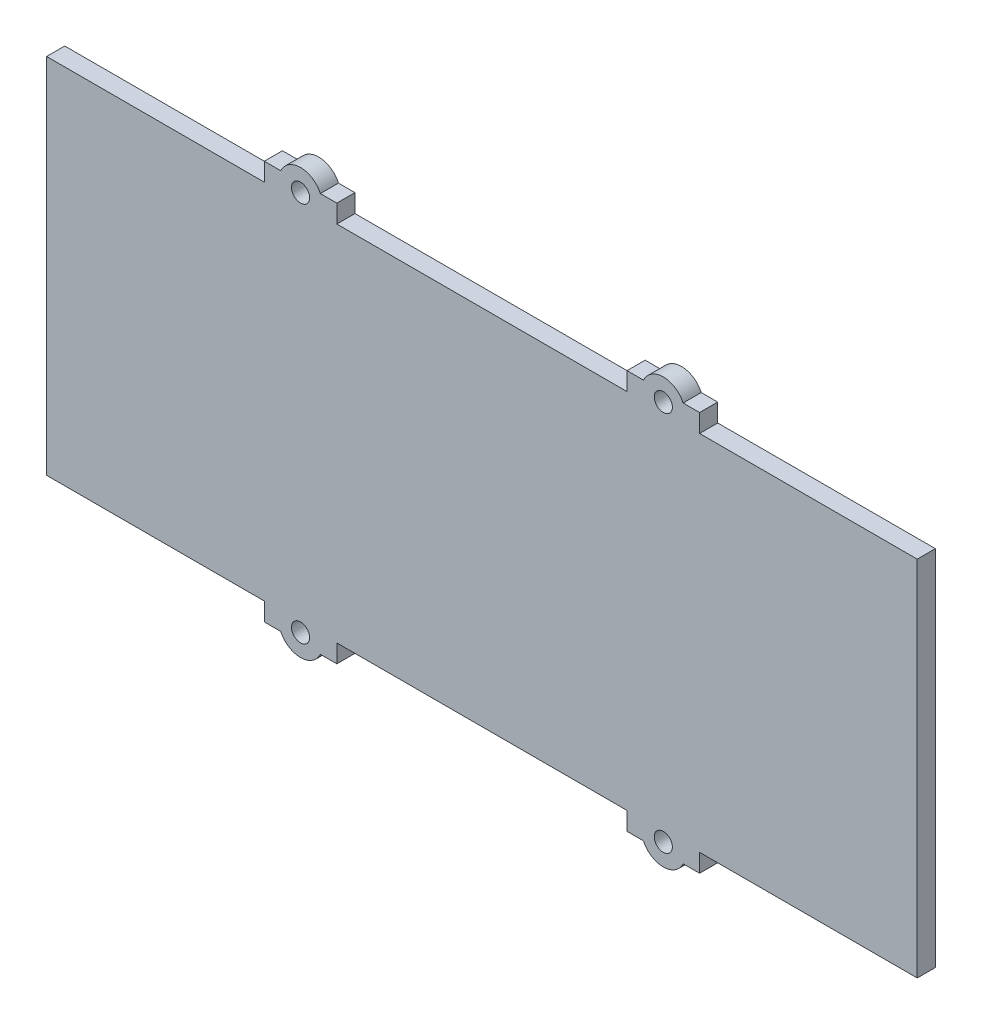
ISO-10303-21;
HEADER;
FILE_DESCRIPTION(('STEP AP214'),'2;1');
FILE_NAME('part.step','',(''),(''),'','','');
FILE_SCHEMA(('AUTOMOTIVE_DESIGN { 1 0 10303 214 1 1 1 1 }'));
ENDSEC;
DATA;
#1=APPLICATION_CONTEXT('core data for automotive mechanical design processes');
#2=APPLICATION_PROTOCOL_DEFINITION('international standard','automotive_design',2000,#1);
#3=PRODUCT_CONTEXT('',#1,'mechanical');
#4=PRODUCT('Part','Part','',(#3));
#5=PRODUCT_RELATED_PRODUCT_CATEGORY('part','',(#4));
#6=PRODUCT_DEFINITION_FORMATION('','',#4);
#7=PRODUCT_DEFINITION_CONTEXT('part definition',#1,'design');
#8=PRODUCT_DEFINITION('design','',#6,#7);
#9=PRODUCT_DEFINITION_SHAPE('','',#8);
#10=(LENGTH_UNIT() NAMED_UNIT(*) SI_UNIT(.MILLI.,.METRE.));
#11=(NAMED_UNIT(*) PLANE_ANGLE_UNIT() SI_UNIT($,.RADIAN.));
#12=(NAMED_UNIT(*) SI_UNIT($,.STERADIAN.) SOLID_ANGLE_UNIT());
#13=UNCERTAINTY_MEASURE_WITH_UNIT(LENGTH_MEASURE(1.E-05),#10,'distance_accuracy_value','');
#14=(GEOMETRIC_REPRESENTATION_CONTEXT(3) GLOBAL_UNCERTAINTY_ASSIGNED_CONTEXT((#13)) GLOBAL_UNIT_ASSIGNED_CONTEXT((#10,
#11,#12)) REPRESENTATION_CONTEXT('',''));
#15=CARTESIAN_POINT('',(0.,0.,0.));
#16=DIRECTION('',(0.,0.,1.));
#17=DIRECTION('',(1.,0.,0.));
#18=AXIS2_PLACEMENT_3D('',#15,#16,#17);
#19=CARTESIAN_POINT('',(0.,-55.,0.));
#20=DIRECTION('',(0.,1.,0.));
#21=DIRECTION('',(0.,0.,-1.));
#22=AXIS2_PLACEMENT_3D('',#19,#20,#21);
#23=PLANE('',#22);
#24=DIRECTION('',(1.,0.,0.));
#25=VECTOR('',#24,1.);
#26=CARTESIAN_POINT('',(-60.,-55.,0.));
#27=LINE('',#26,#25);
#28=CARTESIAN_POINT('',(-60.,-55.,0.));
#29=VERTEX_POINT('',#28);
#30=CARTESIAN_POINT('',(-55.4543560573178,-55.,0.));
#31=VERTEX_POINT('',#30);
#32=EDGE_CURVE('E229',#29,#31,#27,.T.);
#33=ORIENTED_EDGE('',*,*,#32,.T.);
#34=DIRECTION('',(0.,0.,1.));
#35=VECTOR('',#34,1.);
#36=CARTESIAN_POINT('',(-55.4543560573178,-55.,0.));
#37=LINE('',#36,#35);
#38=CARTESIAN_POINT('',(-55.4543560573178,-55.,5.));
#39=VERTEX_POINT('',#38);
#40=EDGE_CURVE('E11',#31,#39,#37,.T.);
#41=ORIENTED_EDGE('',*,*,#40,.T.);
#42=DIRECTION('',(-1.,0.,0.));
#43=VECTOR('',#42,1.);
#44=CARTESIAN_POINT('',(-60.,-55.,5.));
#45=LINE('',#44,#43);
#46=CARTESIAN_POINT('',(-60.,-55.,5.));
#47=VERTEX_POINT('',#46);
#48=EDGE_CURVE('E215',#39,#47,#45,.T.);
#49=ORIENTED_EDGE('',*,*,#48,.T.);
#50=DIRECTION('',(0.,0.,-1.));
#51=VECTOR('',#50,1.);
#52=CARTESIAN_POINT('',(-60.,-55.,0.));
#53=LINE('',#52,#51);
#54=EDGE_CURVE('E268',#47,#29,#53,.T.);
#55=ORIENTED_EDGE('',*,*,#54,.T.);
#56=EDGE_LOOP('',(#33,#41,#49,#55));
#57=FACE_BOUND('',#56,.T.);
#58=ADVANCED_FACE('F33',(#57),#23,.F.);
#59=CARTESIAN_POINT('',(0.,-55.,0.));
#60=DIRECTION('',(0.,1.,0.));
#61=DIRECTION('',(0.,0.,-1.));
#62=AXIS2_PLACEMENT_3D('',#59,#60,#61);
#63=PLANE('',#62);
#64=DIRECTION('',(0.,0.,1.));
#65=VECTOR('',#64,1.);
#66=CARTESIAN_POINT('',(44.5456439426821,-55.,0.));
#67=LINE('',#66,#65);
#68=CARTESIAN_POINT('',(44.5456439426821,-55.,5.));
#69=VERTEX_POINT('',#68);
#70=CARTESIAN_POINT('',(44.5456439426821,-55.,0.));
#71=VERTEX_POINT('',#70);
#72=EDGE_CURVE('E431',#69,#71,#67,.F.);
#73=ORIENTED_EDGE('',*,*,#72,.F.);
#74=DIRECTION('',(1.,0.,0.));
#75=VECTOR('',#74,1.);
#76=CARTESIAN_POINT('',(60.,-55.,5.));
#77=LINE('',#76,#75);
#78=CARTESIAN_POINT('',(40.,-55.,5.));
#79=VERTEX_POINT('',#78);
#80=EDGE_CURVE('E325',#79,#69,#77,.T.);
#81=ORIENTED_EDGE('',*,*,#80,.F.);
#82=DIRECTION('',(0.,0.,1.));
#83=VECTOR('',#82,1.);
#84=CARTESIAN_POINT('',(40.,-55.,0.));
#85=LINE('',#84,#83);
#86=CARTESIAN_POINT('',(40.,-55.,0.));
#87=VERTEX_POINT('',#86);
#88=EDGE_CURVE('E328',#87,#79,#85,.T.);
#89=ORIENTED_EDGE('',*,*,#88,.F.);
#90=DIRECTION('',(-1.,0.,0.));
#91=VECTOR('',#90,1.);
#92=CARTESIAN_POINT('',(60.,-55.,0.));
#93=LINE('',#92,#91);
#94=EDGE_CURVE('E331',#71,#87,#93,.T.);
#95=ORIENTED_EDGE('',*,*,#94,.F.);
#96=EDGE_LOOP('',(#73,#81,#89,#95));
#97=FACE_BOUND('',#96,.T.);
#98=ADVANCED_FACE('F450',(#97),#63,.F.);
#99=DIRECTION('',(0.,0.,1.));
#100=VECTOR('',#99,1.);
#101=CARTESIAN_POINT('',(55.4543560573178,-55.,0.));
#102=LINE('',#101,#100);
#103=CARTESIAN_POINT('',(55.4543560573178,-55.,0.));
#104=VERTEX_POINT('',#103);
#105=CARTESIAN_POINT('',(55.4543560573178,-55.,5.));
#106=VERTEX_POINT('',#105);
#107=EDGE_CURVE('E428',#104,#106,#102,.T.);
#108=ORIENTED_EDGE('',*,*,#107,.F.);
#109=CARTESIAN_POINT('',(60.,-55.,0.));
#110=VERTEX_POINT('',#109);
#111=EDGE_CURVE('E332',#110,#104,#93,.T.);
#112=ORIENTED_EDGE('',*,*,#111,.F.);
#113=DIRECTION('',(0.,0.,-1.));
#114=VECTOR('',#113,1.);
#115=CARTESIAN_POINT('',(60.,-55.,0.));
#116=LINE('',#115,#114);
#117=CARTESIAN_POINT('',(60.,-55.,5.));
#118=VERTEX_POINT('',#117);
#119=EDGE_CURVE('E320',#118,#110,#116,.T.);
#120=ORIENTED_EDGE('',*,*,#119,.F.);
#121=EDGE_CURVE('E323',#106,#118,#77,.T.);
#122=ORIENTED_EDGE('',*,*,#121,.F.);
#123=EDGE_LOOP('',(#108,#112,#120,#122));
#124=FACE_BOUND('',#123,.T.);
#125=ADVANCED_FACE('F447',(#124),#63,.F.);
#126=CARTESIAN_POINT('',(0.,55.,0.));
#127=DIRECTION('',(0.,-1.,0.));
#128=DIRECTION('',(0.,0.,-1.));
#129=AXIS2_PLACEMENT_3D('',#126,#127,#128);
#130=PLANE('',#129);
#131=DIRECTION('',(0.,0.,1.));
#132=VECTOR('',#131,1.);
#133=CARTESIAN_POINT('',(-44.5456439426821,55.,0.));
#134=LINE('',#133,#132);
#135=CARTESIAN_POINT('',(-44.5456439426821,55.,5.));
#136=VERTEX_POINT('',#135);
#137=CARTESIAN_POINT('',(-44.5456439426821,55.,0.));
#138=VERTEX_POINT('',#137);
#139=EDGE_CURVE('E425',#136,#138,#134,.F.);
#140=ORIENTED_EDGE('',*,*,#139,.F.);
#141=DIRECTION('',(-1.,0.,0.));
#142=VECTOR('',#141,1.);
#143=CARTESIAN_POINT('',(-60.,55.,5.));
#144=LINE('',#143,#142);
#145=CARTESIAN_POINT('',(-40.,55.,5.));
#146=VERTEX_POINT('',#145);
#147=EDGE_CURVE('E294',#146,#136,#144,.T.);
#148=ORIENTED_EDGE('',*,*,#147,.F.);
#149=DIRECTION('',(0.,0.,1.));
#150=VECTOR('',#149,1.);
#151=CARTESIAN_POINT('',(-40.,55.,0.));
#152=LINE('',#151,#150);
#153=CARTESIAN_POINT('',(-40.,55.,0.));
#154=VERTEX_POINT('',#153);
#155=EDGE_CURVE('E297',#154,#146,#152,.T.);
#156=ORIENTED_EDGE('',*,*,#155,.F.);
#157=DIRECTION('',(1.,0.,0.));
#158=VECTOR('',#157,1.);
#159=CARTESIAN_POINT('',(-60.,55.,0.));
#160=LINE('',#159,#158);
#161=EDGE_CURVE('E300',#138,#154,#160,.T.);
#162=ORIENTED_EDGE('',*,*,#161,.F.);
#163=EDGE_LOOP('',(#140,#148,#156,#162));
#164=FACE_BOUND('',#163,.T.);
#165=ADVANCED_FACE('F489',(#164),#130,.F.);
#166=DIRECTION('',(0.,0.,1.));
#167=VECTOR('',#166,1.);
#168=CARTESIAN_POINT('',(-55.4543560573178,55.,0.));
#169=LINE('',#168,#167);
#170=CARTESIAN_POINT('',(-55.4543560573178,55.,0.));
#171=VERTEX_POINT('',#170);
#172=CARTESIAN_POINT('',(-55.4543560573178,55.,5.));
#173=VERTEX_POINT('',#172);
#174=EDGE_CURVE('E422',#171,#173,#169,.T.);
#175=ORIENTED_EDGE('',*,*,#174,.F.);
#176=CARTESIAN_POINT('',(-60.,55.,0.));
#177=VERTEX_POINT('',#176);
#178=EDGE_CURVE('E301',#177,#171,#160,.T.);
#179=ORIENTED_EDGE('',*,*,#178,.F.);
#180=DIRECTION('',(0.,0.,-1.));
#181=VECTOR('',#180,1.);
#182=CARTESIAN_POINT('',(-60.,55.,0.));
#183=LINE('',#182,#181);
#184=CARTESIAN_POINT('',(-60.,55.,5.));
#185=VERTEX_POINT('',#184);
#186=EDGE_CURVE('E289',#185,#177,#183,.T.);
#187=ORIENTED_EDGE('',*,*,#186,.F.);
#188=EDGE_CURVE('E292',#173,#185,#144,.T.);
#189=ORIENTED_EDGE('',*,*,#188,.F.);
#190=EDGE_LOOP('',(#175,#179,#187,#189));
#191=FACE_BOUND('',#190,.T.);
#192=ADVANCED_FACE('F482',(#191),#130,.F.);
#193=CARTESIAN_POINT('',(0.,55.,0.));
#194=DIRECTION('',(0.,-1.,0.));
#195=DIRECTION('',(0.,0.,-1.));
#196=AXIS2_PLACEMENT_3D('',#193,#194,#195);
#197=PLANE('',#196);
#198=DIRECTION('',(-1.,0.,0.));
#199=VECTOR('',#198,1.);
#200=CARTESIAN_POINT('',(60.,55.,0.));
#201=LINE('',#200,#199);
#202=CARTESIAN_POINT('',(60.,55.,0.));
#203=VERTEX_POINT('',#202);
#204=CARTESIAN_POINT('',(55.4543560573178,55.,0.));
#205=VERTEX_POINT('',#204);
#206=EDGE_CURVE('E355',#203,#205,#201,.T.);
#207=ORIENTED_EDGE('',*,*,#206,.T.);
#208=DIRECTION('',(0.,0.,1.));
#209=VECTOR('',#208,1.);
#210=CARTESIAN_POINT('',(55.4543560573178,55.,0.));
#211=LINE('',#210,#209);
#212=CARTESIAN_POINT('',(55.4543560573178,55.,5.));
#213=VERTEX_POINT('',#212);
#214=EDGE_CURVE('E419',#205,#213,#211,.T.);
#215=ORIENTED_EDGE('',*,*,#214,.T.);
#216=DIRECTION('',(1.,0.,0.));
#217=VECTOR('',#216,1.);
#218=CARTESIAN_POINT('',(60.,55.,5.));
#219=LINE('',#218,#217);
#220=CARTESIAN_POINT('',(60.,55.,5.));
#221=VERTEX_POINT('',#220);
#222=EDGE_CURVE('E359',#213,#221,#219,.T.);
#223=ORIENTED_EDGE('',*,*,#222,.T.);
#224=DIRECTION('',(0.,0.,-1.));
#225=VECTOR('',#224,1.);
#226=CARTESIAN_POINT('',(60.,55.,0.));
#227=LINE('',#226,#225);
#228=EDGE_CURVE('E350',#221,#203,#227,.T.);
#229=ORIENTED_EDGE('',*,*,#228,.T.);
#230=EDGE_LOOP('',(#207,#215,#223,#229));
#231=FACE_BOUND('',#230,.T.);
#232=ADVANCED_FACE('F514',(#231),#197,.F.);
#233=CARTESIAN_POINT('',(120.,-50.,5.));
#234=DIRECTION('',(0.,1.,0.));
#235=DIRECTION('',(-1.,0.,0.));
#236=AXIS2_PLACEMENT_3D('',#233,#234,#235);
#237=PLANE('',#236);
#238=DIRECTION('',(0.,0.,-1.));
#239=VECTOR('',#238,1.);
#240=CARTESIAN_POINT('',(-60.,-50.,0.));
#241=LINE('',#240,#239);
#242=CARTESIAN_POINT('',(-60.,-50.,5.));
#243=VERTEX_POINT('',#242);
#244=CARTESIAN_POINT('',(-60.,-50.,0.));
#245=VERTEX_POINT('',#244);
#246=EDGE_CURVE('E265',#243,#245,#241,.T.);
#247=ORIENTED_EDGE('',*,*,#246,.F.);
#248=DIRECTION('',(1.,0.,0.));
#249=VECTOR('',#248,1.);
#250=CARTESIAN_POINT('',(120.,-50.,5.));
#251=LINE('',#250,#249);
#252=CARTESIAN_POINT('',(-120.,-50.,5.));
#253=VERTEX_POINT('',#252);
#254=EDGE_CURVE('E384',#253,#243,#251,.T.);
#255=ORIENTED_EDGE('',*,*,#254,.F.);
#256=DIRECTION('',(0.,0.,-1.));
#257=VECTOR('',#256,1.);
#258=CARTESIAN_POINT('',(-120.,-50.,5.));
#259=LINE('',#258,#257);
#260=CARTESIAN_POINT('',(-120.,-50.,0.));
#261=VERTEX_POINT('',#260);
#262=EDGE_CURVE('E414',#253,#261,#259,.T.);
#263=ORIENTED_EDGE('',*,*,#262,.T.);
#264=DIRECTION('',(1.,0.,0.));
#265=VECTOR('',#264,1.);
#266=CARTESIAN_POINT('',(120.,-50.,0.));
#267=LINE('',#266,#265);
#268=EDGE_CURVE('E398',#261,#245,#267,.T.);
#269=ORIENTED_EDGE('',*,*,#268,.T.);
#270=EDGE_LOOP('',(#247,#255,#263,#269));
#271=FACE_BOUND('',#270,.T.);
#272=ADVANCED_FACE('F467',(#271),#237,.F.);
#273=DIRECTION('',(0.,0.,1.));
#274=VECTOR('',#273,1.);
#275=CARTESIAN_POINT('',(-40.,-50.,0.));
#276=LINE('',#275,#274);
#277=CARTESIAN_POINT('',(-40.,-50.,0.));
#278=VERTEX_POINT('',#277);
#279=CARTESIAN_POINT('',(-40.,-50.,5.));
#280=VERTEX_POINT('',#279);
#281=EDGE_CURVE('E271',#278,#280,#276,.T.);
#282=ORIENTED_EDGE('',*,*,#281,.F.);
#283=CARTESIAN_POINT('',(40.,-50.,0.));
#284=VERTEX_POINT('',#283);
#285=EDGE_CURVE('E401',#278,#284,#267,.T.);
#286=ORIENTED_EDGE('',*,*,#285,.T.);
#287=DIRECTION('',(0.,0.,1.));
#288=VECTOR('',#287,1.);
#289=CARTESIAN_POINT('',(40.,-50.,0.));
#290=LINE('',#289,#288);
#291=CARTESIAN_POINT('',(40.,-50.,5.));
#292=VERTEX_POINT('',#291);
#293=EDGE_CURVE('E324',#284,#292,#290,.T.);
#294=ORIENTED_EDGE('',*,*,#293,.T.);
#295=EDGE_CURVE('E387',#280,#292,#251,.T.);
#296=ORIENTED_EDGE('',*,*,#295,.F.);
#297=EDGE_LOOP('',(#282,#286,#294,#296));
#298=FACE_BOUND('',#297,.T.);
#299=ADVANCED_FACE('F458',(#298),#237,.F.);
#300=CARTESIAN_POINT('',(120.,50.,5.));
#301=DIRECTION('',(0.,-1.,0.));
#302=DIRECTION('',(1.,0.,0.));
#303=AXIS2_PLACEMENT_3D('',#300,#301,#302);
#304=PLANE('',#303);
#305=DIRECTION('',(-1.,0.,0.));
#306=VECTOR('',#305,1.);
#307=CARTESIAN_POINT('',(120.,50.,5.));
#308=LINE('',#307,#306);
#309=CARTESIAN_POINT('',(-60.,50.,5.));
#310=VERTEX_POINT('',#309);
#311=CARTESIAN_POINT('',(-120.,50.,5.));
#312=VERTEX_POINT('',#311);
#313=EDGE_CURVE('E389',#310,#312,#308,.T.);
#314=ORIENTED_EDGE('',*,*,#313,.F.);
#315=DIRECTION('',(0.,0.,-1.));
#316=VECTOR('',#315,1.);
#317=CARTESIAN_POINT('',(-60.,50.,0.));
#318=LINE('',#317,#316);
#319=CARTESIAN_POINT('',(-60.,50.,0.));
#320=VERTEX_POINT('',#319);
#321=EDGE_CURVE('E288',#310,#320,#318,.T.);
#322=ORIENTED_EDGE('',*,*,#321,.T.);
#323=DIRECTION('',(-1.,0.,0.));
#324=VECTOR('',#323,1.);
#325=CARTESIAN_POINT('',(120.,50.,0.));
#326=LINE('',#325,#324);
#327=CARTESIAN_POINT('',(-120.,50.,0.));
#328=VERTEX_POINT('',#327);
#329=EDGE_CURVE('E403',#320,#328,#326,.T.);
#330=ORIENTED_EDGE('',*,*,#329,.T.);
#331=DIRECTION('',(0.,0.,-1.));
#332=VECTOR('',#331,1.);
#333=CARTESIAN_POINT('',(-120.,50.,5.));
#334=LINE('',#333,#332);
#335=EDGE_CURVE('E393',#312,#328,#334,.T.);
#336=ORIENTED_EDGE('',*,*,#335,.F.);
#337=EDGE_LOOP('',(#314,#322,#330,#336));
#338=FACE_BOUND('',#337,.T.);
#339=ADVANCED_FACE('F475',(#338),#304,.F.);
#340=CARTESIAN_POINT('',(60.,-50.,5.));
#341=VERTEX_POINT('',#340);
#342=CARTESIAN_POINT('',(120.,-50.,5.));
#343=VERTEX_POINT('',#342);
#344=EDGE_CURVE('E382',#341,#343,#251,.T.);
#345=ORIENTED_EDGE('',*,*,#344,.F.);
#346=DIRECTION('',(0.,0.,-1.));
#347=VECTOR('',#346,1.);
#348=CARTESIAN_POINT('',(60.,-50.,0.));
#349=LINE('',#348,#347);
#350=CARTESIAN_POINT('',(60.,-50.,0.));
#351=VERTEX_POINT('',#350);
#352=EDGE_CURVE('E319',#341,#351,#349,.T.);
#353=ORIENTED_EDGE('',*,*,#352,.T.);
#354=CARTESIAN_POINT('',(120.,-50.,0.));
#355=VERTEX_POINT('',#354);
#356=EDGE_CURVE('E397',#351,#355,#267,.T.);
#357=ORIENTED_EDGE('',*,*,#356,.T.);
#358=DIRECTION('',(0.,0.,-1.));
#359=VECTOR('',#358,1.);
#360=CARTESIAN_POINT('',(120.,-50.,5.));
#361=LINE('',#360,#359);
#362=EDGE_CURVE('E411',#343,#355,#361,.T.);
#363=ORIENTED_EDGE('',*,*,#362,.F.);
#364=EDGE_LOOP('',(#345,#353,#357,#363));
#365=FACE_BOUND('',#364,.T.);
#366=ADVANCED_FACE('F532',(#365),#237,.F.);
#367=DIRECTION('',(0.,0.,-1.));
#368=VECTOR('',#367,1.);
#369=CARTESIAN_POINT('',(60.,50.,0.));
#370=LINE('',#369,#368);
#371=CARTESIAN_POINT('',(60.,50.,5.));
#372=VERTEX_POINT('',#371);
#373=CARTESIAN_POINT('',(60.,50.,0.));
#374=VERTEX_POINT('',#373);
#375=EDGE_CURVE('E349',#372,#374,#370,.T.);
#376=ORIENTED_EDGE('',*,*,#375,.F.);
#377=CARTESIAN_POINT('',(120.,50.,5.));
#378=VERTEX_POINT('',#377);
#379=EDGE_CURVE('E390',#378,#372,#308,.T.);
#380=ORIENTED_EDGE('',*,*,#379,.F.);
#381=DIRECTION('',(0.,0.,-1.));
#382=VECTOR('',#381,1.);
#383=CARTESIAN_POINT('',(120.,50.,5.));
#384=LINE('',#383,#382);
#385=CARTESIAN_POINT('',(120.,50.,0.));
#386=VERTEX_POINT('',#385);
#387=EDGE_CURVE('E408',#378,#386,#384,.T.);
#388=ORIENTED_EDGE('',*,*,#387,.T.);
#389=EDGE_CURVE('E383',#386,#374,#326,.T.);
#390=ORIENTED_EDGE('',*,*,#389,.T.);
#391=EDGE_LOOP('',(#376,#380,#388,#390));
#392=FACE_BOUND('',#391,.T.);
#393=ADVANCED_FACE('F524',(#392),#304,.F.);
#394=CARTESIAN_POINT('',(40.,50.,0.));
#395=VERTEX_POINT('',#394);
#396=CARTESIAN_POINT('',(-40.,50.,0.));
#397=VERTEX_POINT('',#396);
#398=EDGE_CURVE('E405',#395,#397,#326,.T.);
#399=ORIENTED_EDGE('',*,*,#398,.T.);
#400=DIRECTION('',(0.,0.,1.));
#401=VECTOR('',#400,1.);
#402=CARTESIAN_POINT('',(-40.,50.,0.));
#403=LINE('',#402,#401);
#404=CARTESIAN_POINT('',(-40.,50.,5.));
#405=VERTEX_POINT('',#404);
#406=EDGE_CURVE('E293',#397,#405,#403,.T.);
#407=ORIENTED_EDGE('',*,*,#406,.T.);
#408=CARTESIAN_POINT('',(40.,50.,5.));
#409=VERTEX_POINT('',#408);
#410=EDGE_CURVE('E394',#409,#405,#308,.T.);
#411=ORIENTED_EDGE('',*,*,#410,.F.);
#412=DIRECTION('',(0.,0.,1.));
#413=VECTOR('',#412,1.);
#414=CARTESIAN_POINT('',(40.,50.,0.));
#415=LINE('',#414,#413);
#416=EDGE_CURVE('E354',#395,#409,#415,.T.);
#417=ORIENTED_EDGE('',*,*,#416,.F.);
#418=EDGE_LOOP('',(#399,#407,#411,#417));
#419=FACE_BOUND('',#418,.T.);
#420=ADVANCED_FACE('F792',(#419),#304,.F.);
#421=CARTESIAN_POINT('',(-120.,50.,5.));
#422=DIRECTION('',(1.,0.,0.));
#423=DIRECTION('',(0.,1.,0.));
#424=AXIS2_PLACEMENT_3D('',#421,#422,#423);
#425=PLANE('',#424);
#426=DIRECTION('',(0.,-1.,0.));
#427=VECTOR('',#426,1.);
#428=CARTESIAN_POINT('',(-120.,50.,0.));
#429=LINE('',#428,#427);
#430=EDGE_CURVE('E378',#328,#261,#429,.T.);
#431=ORIENTED_EDGE('',*,*,#430,.T.);
#432=ORIENTED_EDGE('',*,*,#262,.F.);
#433=DIRECTION('',(0.,-1.,0.));
#434=VECTOR('',#433,1.);
#435=CARTESIAN_POINT('',(-120.,50.,5.));
#436=LINE('',#435,#434);
#437=EDGE_CURVE('E379',#312,#253,#436,.T.);
#438=ORIENTED_EDGE('',*,*,#437,.F.);
#439=ORIENTED_EDGE('',*,*,#335,.T.);
#440=EDGE_LOOP('',(#431,#432,#438,#439));
#441=FACE_BOUND('',#440,.T.);
#442=ADVANCED_FACE('F35',(#441),#425,.F.);
#443=CARTESIAN_POINT('',(120.,50.,5.));
#444=DIRECTION('',(-1.,0.,0.));
#445=DIRECTION('',(0.,-1.,0.));
#446=AXIS2_PLACEMENT_3D('',#443,#444,#445);
#447=PLANE('',#446);
#448=DIRECTION('',(0.,1.,0.));
#449=VECTOR('',#448,1.);
#450=CARTESIAN_POINT('',(120.,50.,0.));
#451=LINE('',#450,#449);
#452=EDGE_CURVE('E400',#355,#386,#451,.T.);
#453=ORIENTED_EDGE('',*,*,#452,.T.);
#454=ORIENTED_EDGE('',*,*,#387,.F.);
#455=DIRECTION('',(0.,1.,0.));
#456=VECTOR('',#455,1.);
#457=CARTESIAN_POINT('',(120.,50.,5.));
#458=LINE('',#457,#456);
#459=EDGE_CURVE('E386',#343,#378,#458,.T.);
#460=ORIENTED_EDGE('',*,*,#459,.F.);
#461=ORIENTED_EDGE('',*,*,#362,.T.);
#462=EDGE_LOOP('',(#453,#454,#460,#461));
#463=FACE_BOUND('',#462,.T.);
#464=ADVANCED_FACE('F530',(#463),#447,.F.);
#465=CARTESIAN_POINT('',(0.,0.,5.));
#466=DIRECTION('',(0.,0.,-1.));
#467=DIRECTION('',(-1.,0.,0.));
#468=AXIS2_PLACEMENT_3D('',#465,#466,#467);
#469=PLANE('',#468);
#470=CARTESIAN_POINT('',(-50.,-52.5,5.));
#471=DIRECTION('',(0.,0.,1.));
#472=DIRECTION('',(-1.,0.,0.));
#473=AXIS2_PLACEMENT_3D('',#470,#471,#472);
#474=CIRCLE('',#473,2.5);
#475=CARTESIAN_POINT('',(-52.5,-52.5,5.));
#476=VERTEX_POINT('',#475);
#477=EDGE_CURVE('E740',#476,#476,#474,.T.);
#478=ORIENTED_EDGE('',*,*,#477,.F.);
#479=EDGE_LOOP('',(#478));
#480=FACE_BOUND('',#479,.T.);
#481=CARTESIAN_POINT('',(50.,-52.5,5.));
#482=DIRECTION('',(0.,0.,-1.));
#483=DIRECTION('',(1.,0.,0.));
#484=AXIS2_PLACEMENT_3D('',#481,#482,#483);
#485=CIRCLE('',#484,2.5);
#486=CARTESIAN_POINT('',(52.5,-52.5,5.));
#487=VERTEX_POINT('',#486);
#488=EDGE_CURVE('E742',#487,#487,#485,.T.);
#489=ORIENTED_EDGE('',*,*,#488,.T.);
#490=EDGE_LOOP('',(#489));
#491=FACE_BOUND('',#490,.T.);
#492=CARTESIAN_POINT('',(-50.,52.5,5.));
#493=DIRECTION('',(0.,0.,-1.));
#494=DIRECTION('',(-1.,0.,0.));
#495=AXIS2_PLACEMENT_3D('',#492,#493,#494);
#496=CIRCLE('',#495,2.5);
#497=CARTESIAN_POINT('',(-52.5,52.5,5.));
#498=VERTEX_POINT('',#497);
#499=EDGE_CURVE('E240',#498,#498,#496,.T.);
#500=ORIENTED_EDGE('',*,*,#499,.T.);
#501=EDGE_LOOP('',(#500));
#502=FACE_BOUND('',#501,.T.);
#503=ORIENTED_EDGE('',*,*,#48,.F.);
#504=CARTESIAN_POINT('',(-50.,-52.5,5.));
#505=DIRECTION('',(0.,0.,1.));
#506=DIRECTION('',(-1.,0.,0.));
#507=AXIS2_PLACEMENT_3D('',#504,#505,#506);
#508=CIRCLE('',#507,6.);
#509=CARTESIAN_POINT('',(-44.5456439426821,-55.,5.));
#510=VERTEX_POINT('',#509);
#511=EDGE_CURVE('E219',#39,#510,#508,.T.);
#512=ORIENTED_EDGE('',*,*,#511,.T.);
#513=CARTESIAN_POINT('',(-40.,-55.,5.));
#514=VERTEX_POINT('',#513);
#515=EDGE_CURVE('E48',#514,#510,#45,.T.);
#516=ORIENTED_EDGE('',*,*,#515,.F.);
#517=DIRECTION('',(0.,1.,0.));
#518=VECTOR('',#517,1.);
#519=CARTESIAN_POINT('',(-40.,-55.,5.));
#520=LINE('',#519,#518);
#521=EDGE_CURVE('E279',#514,#280,#520,.T.);
#522=ORIENTED_EDGE('',*,*,#521,.T.);
#523=ORIENTED_EDGE('',*,*,#295,.T.);
#524=DIRECTION('',(0.,1.,0.));
#525=VECTOR('',#524,1.);
#526=CARTESIAN_POINT('',(40.,-55.,5.));
#527=LINE('',#526,#525);
#528=EDGE_CURVE('E344',#79,#292,#527,.T.);
#529=ORIENTED_EDGE('',*,*,#528,.F.);
#530=ORIENTED_EDGE('',*,*,#80,.T.);
#531=CARTESIAN_POINT('',(50.,-52.5,5.));
#532=DIRECTION('',(0.,0.,-1.));
#533=DIRECTION('',(1.,0.,0.));
#534=AXIS2_PLACEMENT_3D('',#531,#532,#533);
#535=CIRCLE('',#534,6.);
#536=EDGE_CURVE('E237',#106,#69,#535,.T.);
#537=ORIENTED_EDGE('',*,*,#536,.F.);
#538=ORIENTED_EDGE('',*,*,#121,.T.);
#539=DIRECTION('',(0.,1.,0.));
#540=VECTOR('',#539,1.);
#541=CARTESIAN_POINT('',(60.,-55.,5.));
#542=LINE('',#541,#540);
#543=EDGE_CURVE('E347',#118,#341,#542,.T.);
#544=ORIENTED_EDGE('',*,*,#543,.T.);
#545=ORIENTED_EDGE('',*,*,#344,.T.);
#546=ORIENTED_EDGE('',*,*,#459,.T.);
#547=ORIENTED_EDGE('',*,*,#379,.T.);
#548=DIRECTION('',(0.,-1.,0.));
#549=VECTOR('',#548,1.);
#550=CARTESIAN_POINT('',(60.,55.,5.));
#551=LINE('',#550,#549);
#552=EDGE_CURVE('E362',#221,#372,#551,.T.);
#553=ORIENTED_EDGE('',*,*,#552,.F.);
#554=ORIENTED_EDGE('',*,*,#222,.F.);
#555=CARTESIAN_POINT('',(50.,52.5,5.));
#556=DIRECTION('',(0.,0.,1.));
#557=DIRECTION('',(1.,0.,0.));
#558=AXIS2_PLACEMENT_3D('',#555,#556,#557);
#559=CIRCLE('',#558,6.);
#560=CARTESIAN_POINT('',(44.5456439426821,55.,5.));
#561=VERTEX_POINT('',#560);
#562=EDGE_CURVE('E259',#213,#561,#559,.T.);
#563=ORIENTED_EDGE('',*,*,#562,.T.);
#564=CARTESIAN_POINT('',(40.,55.,5.));
#565=VERTEX_POINT('',#564);
#566=EDGE_CURVE('E360',#565,#561,#219,.T.);
#567=ORIENTED_EDGE('',*,*,#566,.F.);
#568=DIRECTION('',(0.,-1.,0.));
#569=VECTOR('',#568,1.);
#570=CARTESIAN_POINT('',(40.,55.,5.));
#571=LINE('',#570,#569);
#572=EDGE_CURVE('E369',#565,#409,#571,.T.);
#573=ORIENTED_EDGE('',*,*,#572,.T.);
#574=ORIENTED_EDGE('',*,*,#410,.T.);
#575=DIRECTION('',(0.,-1.,0.));
#576=VECTOR('',#575,1.);
#577=CARTESIAN_POINT('',(-40.,55.,5.));
#578=LINE('',#577,#576);
#579=EDGE_CURVE('E313',#146,#405,#578,.T.);
#580=ORIENTED_EDGE('',*,*,#579,.F.);
#581=ORIENTED_EDGE('',*,*,#147,.T.);
#582=CARTESIAN_POINT('',(-50.,52.5,5.));
#583=DIRECTION('',(0.,0.,-1.));
#584=DIRECTION('',(-1.,0.,0.));
#585=AXIS2_PLACEMENT_3D('',#582,#583,#584);
#586=CIRCLE('',#585,6.);
#587=EDGE_CURVE('E247',#173,#136,#586,.T.);
#588=ORIENTED_EDGE('',*,*,#587,.F.);
#589=ORIENTED_EDGE('',*,*,#188,.T.);
#590=DIRECTION('',(0.,-1.,0.));
#591=VECTOR('',#590,1.);
#592=CARTESIAN_POINT('',(-60.,55.,5.));
#593=LINE('',#592,#591);
#594=EDGE_CURVE('E316',#185,#310,#593,.T.);
#595=ORIENTED_EDGE('',*,*,#594,.T.);
#596=ORIENTED_EDGE('',*,*,#313,.T.);
#597=ORIENTED_EDGE('',*,*,#437,.T.);
#598=ORIENTED_EDGE('',*,*,#254,.T.);
#599=DIRECTION('',(0.,1.,0.));
#600=VECTOR('',#599,1.);
#601=CARTESIAN_POINT('',(-60.,-55.,5.));
#602=LINE('',#601,#600);
#603=EDGE_CURVE('E222',#47,#243,#602,.T.);
#604=ORIENTED_EDGE('',*,*,#603,.F.);
#605=EDGE_LOOP('',(#503,#512,#516,#522,#523,#529,#530,#537,#538,#544,#545,#546,#547,#553,#554,
#563,#567,#573,#574,#580,#581,#588,#589,#595,#596,#597,#598,#604));
#606=FACE_BOUND('',#605,.T.);
#607=CARTESIAN_POINT('',(50.,52.5,5.));
#608=DIRECTION('',(0.,0.,1.));
#609=DIRECTION('',(1.,0.,0.));
#610=AXIS2_PLACEMENT_3D('',#607,#608,#609);
#611=CIRCLE('',#610,2.5);
#612=CARTESIAN_POINT('',(52.5,52.5,5.));
#613=VERTEX_POINT('',#612);
#614=EDGE_CURVE('E253',#613,#613,#611,.T.);
#615=ORIENTED_EDGE('',*,*,#614,.F.);
#616=EDGE_LOOP('',(#615));
#617=FACE_BOUND('',#616,.T.);
#618=ADVANCED_FACE('F216',(#480,#491,#502,#606,#617),#469,.F.);
#619=CARTESIAN_POINT('',(0.,0.,0.));
#620=DIRECTION('',(0.,0.,-1.));
#621=DIRECTION('',(-1.,0.,0.));
#622=AXIS2_PLACEMENT_3D('',#619,#620,#621);
#623=PLANE('',#622);
#624=CARTESIAN_POINT('',(-50.,-52.5,0.));
#625=DIRECTION('',(0.,0.,1.));
#626=DIRECTION('',(-1.,0.,0.));
#627=AXIS2_PLACEMENT_3D('',#624,#625,#626);
#628=CIRCLE('',#627,2.5);
#629=CARTESIAN_POINT('',(-52.5,-52.5,0.));
#630=VERTEX_POINT('',#629);
#631=EDGE_CURVE('E737',#630,#630,#628,.T.);
#632=ORIENTED_EDGE('',*,*,#631,.T.);
#633=EDGE_LOOP('',(#632));
#634=FACE_BOUND('',#633,.T.);
#635=CARTESIAN_POINT('',(50.,-52.5,0.));
#636=DIRECTION('',(0.,0.,-1.));
#637=DIRECTION('',(1.,0.,0.));
#638=AXIS2_PLACEMENT_3D('',#635,#636,#637);
#639=CIRCLE('',#638,2.5);
#640=CARTESIAN_POINT('',(52.5,-52.5,0.));
#641=VERTEX_POINT('',#640);
#642=EDGE_CURVE('E745',#641,#641,#639,.T.);
#643=ORIENTED_EDGE('',*,*,#642,.F.);
#644=EDGE_LOOP('',(#643));
#645=FACE_BOUND('',#644,.T.);
#646=CARTESIAN_POINT('',(-50.,52.5,0.));
#647=DIRECTION('',(0.,0.,-1.));
#648=DIRECTION('',(-1.,0.,0.));
#649=AXIS2_PLACEMENT_3D('',#646,#647,#648);
#650=CIRCLE('',#649,2.5);
#651=CARTESIAN_POINT('',(-52.5,52.5,0.));
#652=VERTEX_POINT('',#651);
#653=EDGE_CURVE('E235',#652,#652,#650,.T.);
#654=ORIENTED_EDGE('',*,*,#653,.F.);
#655=EDGE_LOOP('',(#654));
#656=FACE_BOUND('',#655,.T.);
#657=CARTESIAN_POINT('',(-44.5456439426821,-55.,0.));
#658=VERTEX_POINT('',#657);
#659=CARTESIAN_POINT('',(-40.,-55.,0.));
#660=VERTEX_POINT('',#659);
#661=EDGE_CURVE('E270',#658,#660,#27,.T.);
#662=ORIENTED_EDGE('',*,*,#661,.F.);
#663=CARTESIAN_POINT('',(-50.,-52.5,0.));
#664=DIRECTION('',(0.,0.,1.));
#665=DIRECTION('',(-1.,0.,0.));
#666=AXIS2_PLACEMENT_3D('',#663,#664,#665);
#667=CIRCLE('',#666,6.);
#668=EDGE_CURVE('E234',#31,#658,#667,.T.);
#669=ORIENTED_EDGE('',*,*,#668,.F.);
#670=ORIENTED_EDGE('',*,*,#32,.F.);
#671=DIRECTION('',(0.,1.,0.));
#672=VECTOR('',#671,1.);
#673=CARTESIAN_POINT('',(-60.,-55.,0.));
#674=LINE('',#673,#672);
#675=EDGE_CURVE('E285',#29,#245,#674,.T.);
#676=ORIENTED_EDGE('',*,*,#675,.T.);
#677=ORIENTED_EDGE('',*,*,#268,.F.);
#678=ORIENTED_EDGE('',*,*,#430,.F.);
#679=ORIENTED_EDGE('',*,*,#329,.F.);
#680=DIRECTION('',(0.,-1.,0.));
#681=VECTOR('',#680,1.);
#682=CARTESIAN_POINT('',(-60.,55.,0.));
#683=LINE('',#682,#681);
#684=EDGE_CURVE('E304',#177,#320,#683,.T.);
#685=ORIENTED_EDGE('',*,*,#684,.F.);
#686=ORIENTED_EDGE('',*,*,#178,.T.);
#687=CARTESIAN_POINT('',(-50.,52.5,0.));
#688=DIRECTION('',(0.,0.,-1.));
#689=DIRECTION('',(-1.,0.,0.));
#690=AXIS2_PLACEMENT_3D('',#687,#688,#689);
#691=CIRCLE('',#690,6.);
#692=EDGE_CURVE('E250',#171,#138,#691,.T.);
#693=ORIENTED_EDGE('',*,*,#692,.T.);
#694=ORIENTED_EDGE('',*,*,#161,.T.);
#695=DIRECTION('',(0.,-1.,0.));
#696=VECTOR('',#695,1.);
#697=CARTESIAN_POINT('',(-40.,55.,0.));
#698=LINE('',#697,#696);
#699=EDGE_CURVE('E310',#154,#397,#698,.T.);
#700=ORIENTED_EDGE('',*,*,#699,.T.);
#701=ORIENTED_EDGE('',*,*,#398,.F.);
#702=DIRECTION('',(0.,-1.,0.));
#703=VECTOR('',#702,1.);
#704=CARTESIAN_POINT('',(40.,55.,0.));
#705=LINE('',#704,#703);
#706=CARTESIAN_POINT('',(40.,55.,0.));
#707=VERTEX_POINT('',#706);
#708=EDGE_CURVE('E372',#707,#395,#705,.T.);
#709=ORIENTED_EDGE('',*,*,#708,.F.);
#710=CARTESIAN_POINT('',(44.5456439426821,55.,0.));
#711=VERTEX_POINT('',#710);
#712=EDGE_CURVE('E353',#711,#707,#201,.T.);
#713=ORIENTED_EDGE('',*,*,#712,.F.);
#714=CARTESIAN_POINT('',(50.,52.5,0.));
#715=DIRECTION('',(0.,0.,1.));
#716=DIRECTION('',(1.,0.,0.));
#717=AXIS2_PLACEMENT_3D('',#714,#715,#716);
#718=CIRCLE('',#717,6.);
#719=EDGE_CURVE('E262',#205,#711,#718,.T.);
#720=ORIENTED_EDGE('',*,*,#719,.F.);
#721=ORIENTED_EDGE('',*,*,#206,.F.);
#722=DIRECTION('',(0.,-1.,0.));
#723=VECTOR('',#722,1.);
#724=CARTESIAN_POINT('',(60.,55.,0.));
#725=LINE('',#724,#723);
#726=EDGE_CURVE('E375',#203,#374,#725,.T.);
#727=ORIENTED_EDGE('',*,*,#726,.T.);
#728=ORIENTED_EDGE('',*,*,#389,.F.);
#729=ORIENTED_EDGE('',*,*,#452,.F.);
#730=ORIENTED_EDGE('',*,*,#356,.F.);
#731=DIRECTION('',(0.,1.,0.));
#732=VECTOR('',#731,1.);
#733=CARTESIAN_POINT('',(60.,-55.,0.));
#734=LINE('',#733,#732);
#735=EDGE_CURVE('E335',#110,#351,#734,.T.);
#736=ORIENTED_EDGE('',*,*,#735,.F.);
#737=ORIENTED_EDGE('',*,*,#111,.T.);
#738=CARTESIAN_POINT('',(50.,-52.5,0.));
#739=DIRECTION('',(0.,0.,-1.));
#740=DIRECTION('',(1.,0.,0.));
#741=AXIS2_PLACEMENT_3D('',#738,#739,#740);
#742=CIRCLE('',#741,6.);
#743=EDGE_CURVE('E244',#104,#71,#742,.T.);
#744=ORIENTED_EDGE('',*,*,#743,.T.);
#745=ORIENTED_EDGE('',*,*,#94,.T.);
#746=DIRECTION('',(0.,1.,0.));
#747=VECTOR('',#746,1.);
#748=CARTESIAN_POINT('',(40.,-55.,0.));
#749=LINE('',#748,#747);
#750=EDGE_CURVE('E341',#87,#284,#749,.T.);
#751=ORIENTED_EDGE('',*,*,#750,.T.);
#752=ORIENTED_EDGE('',*,*,#285,.F.);
#753=DIRECTION('',(0.,1.,0.));
#754=VECTOR('',#753,1.);
#755=CARTESIAN_POINT('',(-40.,-55.,0.));
#756=LINE('',#755,#754);
#757=EDGE_CURVE('E282',#660,#278,#756,.T.);
#758=ORIENTED_EDGE('',*,*,#757,.F.);
#759=EDGE_LOOP('',(#662,#669,#670,#676,#677,#678,#679,#685,#686,#693,#694,#700,#701,#709,#713,
#720,#721,#727,#728,#729,#730,#736,#737,#744,#745,#751,#752,#758));
#760=FACE_BOUND('',#759,.T.);
#761=CARTESIAN_POINT('',(50.,52.5,0.));
#762=DIRECTION('',(0.,0.,1.));
#763=DIRECTION('',(1.,0.,0.));
#764=AXIS2_PLACEMENT_3D('',#761,#762,#763);
#765=CIRCLE('',#764,2.5);
#766=CARTESIAN_POINT('',(52.5,52.5,0.));
#767=VERTEX_POINT('',#766);
#768=EDGE_CURVE('E256',#767,#767,#765,.T.);
#769=ORIENTED_EDGE('',*,*,#768,.T.);
#770=EDGE_LOOP('',(#769));
#771=FACE_BOUND('',#770,.T.);
#772=ADVANCED_FACE('F440',(#634,#645,#656,#760,#771),#623,.T.);
#773=CARTESIAN_POINT('',(60.,55.,0.));
#774=DIRECTION('',(-1.,0.,0.));
#775=DIRECTION('',(0.,-1.,0.));
#776=AXIS2_PLACEMENT_3D('',#773,#774,#775);
#777=PLANE('',#776);
#778=ORIENTED_EDGE('',*,*,#375,.T.);
#779=ORIENTED_EDGE('',*,*,#726,.F.);
#780=ORIENTED_EDGE('',*,*,#228,.F.);
#781=ORIENTED_EDGE('',*,*,#552,.T.);
#782=EDGE_LOOP('',(#778,#779,#780,#781));
#783=FACE_BOUND('',#782,.T.);
#784=ADVANCED_FACE('F521',(#783),#777,.F.);
#785=CARTESIAN_POINT('',(40.,55.,0.));
#786=DIRECTION('',(1.,0.,0.));
#787=DIRECTION('',(0.,1.,0.));
#788=AXIS2_PLACEMENT_3D('',#785,#786,#787);
#789=PLANE('',#788);
#790=ORIENTED_EDGE('',*,*,#416,.T.);
#791=ORIENTED_EDGE('',*,*,#572,.F.);
#792=DIRECTION('',(0.,0.,1.));
#793=VECTOR('',#792,1.);
#794=CARTESIAN_POINT('',(40.,55.,0.));
#795=LINE('',#794,#793);
#796=EDGE_CURVE('E357',#707,#565,#795,.T.);
#797=ORIENTED_EDGE('',*,*,#796,.F.);
#798=ORIENTED_EDGE('',*,*,#708,.T.);
#799=EDGE_LOOP('',(#790,#791,#797,#798));
#800=FACE_BOUND('',#799,.T.);
#801=ADVANCED_FACE('F502',(#800),#789,.F.);
#802=ORIENTED_EDGE('',*,*,#566,.T.);
#803=DIRECTION('',(0.,0.,1.));
#804=VECTOR('',#803,1.);
#805=CARTESIAN_POINT('',(44.5456439426821,55.,0.));
#806=LINE('',#805,#804);
#807=EDGE_CURVE('E417',#561,#711,#806,.F.);
#808=ORIENTED_EDGE('',*,*,#807,.T.);
#809=ORIENTED_EDGE('',*,*,#712,.T.);
#810=ORIENTED_EDGE('',*,*,#796,.T.);
#811=EDGE_LOOP('',(#802,#808,#809,#810));
#812=FACE_BOUND('',#811,.T.);
#813=ADVANCED_FACE('F506',(#812),#197,.F.);
#814=CARTESIAN_POINT('',(60.,-55.,0.));
#815=DIRECTION('',(1.,0.,0.));
#816=DIRECTION('',(0.,1.,0.));
#817=AXIS2_PLACEMENT_3D('',#814,#815,#816);
#818=PLANE('',#817);
#819=ORIENTED_EDGE('',*,*,#352,.F.);
#820=ORIENTED_EDGE('',*,*,#543,.F.);
#821=ORIENTED_EDGE('',*,*,#119,.T.);
#822=ORIENTED_EDGE('',*,*,#735,.T.);
#823=EDGE_LOOP('',(#819,#820,#821,#822));
#824=FACE_BOUND('',#823,.T.);
#825=ADVANCED_FACE('F535',(#824),#818,.T.);
#826=CARTESIAN_POINT('',(40.,-55.,0.));
#827=DIRECTION('',(-1.,0.,0.));
#828=DIRECTION('',(0.,-1.,0.));
#829=AXIS2_PLACEMENT_3D('',#826,#827,#828);
#830=PLANE('',#829);
#831=ORIENTED_EDGE('',*,*,#293,.F.);
#832=ORIENTED_EDGE('',*,*,#750,.F.);
#833=ORIENTED_EDGE('',*,*,#88,.T.);
#834=ORIENTED_EDGE('',*,*,#528,.T.);
#835=EDGE_LOOP('',(#831,#832,#833,#834));
#836=FACE_BOUND('',#835,.T.);
#837=ADVANCED_FACE('F453',(#836),#830,.T.);
#838=CARTESIAN_POINT('',(-60.,55.,0.));
#839=DIRECTION('',(-1.,0.,0.));
#840=DIRECTION('',(0.,-1.,0.));
#841=AXIS2_PLACEMENT_3D('',#838,#839,#840);
#842=PLANE('',#841);
#843=ORIENTED_EDGE('',*,*,#321,.F.);
#844=ORIENTED_EDGE('',*,*,#594,.F.);
#845=ORIENTED_EDGE('',*,*,#186,.T.);
#846=ORIENTED_EDGE('',*,*,#684,.T.);
#847=EDGE_LOOP('',(#843,#844,#845,#846));
#848=FACE_BOUND('',#847,.T.);
#849=ADVANCED_FACE('F478',(#848),#842,.T.);
#850=CARTESIAN_POINT('',(-40.,55.,0.));
#851=DIRECTION('',(1.,0.,0.));
#852=DIRECTION('',(0.,1.,0.));
#853=AXIS2_PLACEMENT_3D('',#850,#851,#852);
#854=PLANE('',#853);
#855=ORIENTED_EDGE('',*,*,#406,.F.);
#856=ORIENTED_EDGE('',*,*,#699,.F.);
#857=ORIENTED_EDGE('',*,*,#155,.T.);
#858=ORIENTED_EDGE('',*,*,#579,.T.);
#859=EDGE_LOOP('',(#855,#856,#857,#858));
#860=FACE_BOUND('',#859,.T.);
#861=ADVANCED_FACE('F494',(#860),#854,.T.);
#862=CARTESIAN_POINT('',(-60.,-55.,0.));
#863=DIRECTION('',(1.,0.,0.));
#864=DIRECTION('',(0.,1.,0.));
#865=AXIS2_PLACEMENT_3D('',#862,#863,#864);
#866=PLANE('',#865);
#867=ORIENTED_EDGE('',*,*,#246,.T.);
#868=ORIENTED_EDGE('',*,*,#675,.F.);
#869=ORIENTED_EDGE('',*,*,#54,.F.);
#870=ORIENTED_EDGE('',*,*,#603,.T.);
#871=EDGE_LOOP('',(#867,#868,#869,#870));
#872=FACE_BOUND('',#871,.T.);
#873=ADVANCED_FACE('F465',(#872),#866,.F.);
#874=CARTESIAN_POINT('',(-40.,-55.,0.));
#875=DIRECTION('',(-1.,0.,0.));
#876=DIRECTION('',(0.,-1.,0.));
#877=AXIS2_PLACEMENT_3D('',#874,#875,#876);
#878=PLANE('',#877);
#879=ORIENTED_EDGE('',*,*,#281,.T.);
#880=ORIENTED_EDGE('',*,*,#521,.F.);
#881=DIRECTION('',(0.,0.,1.));
#882=VECTOR('',#881,1.);
#883=CARTESIAN_POINT('',(-40.,-55.,0.));
#884=LINE('',#883,#882);
#885=EDGE_CURVE('E226',#660,#514,#884,.T.);
#886=ORIENTED_EDGE('',*,*,#885,.F.);
#887=ORIENTED_EDGE('',*,*,#757,.T.);
#888=EDGE_LOOP('',(#879,#880,#886,#887));
#889=FACE_BOUND('',#888,.T.);
#890=ADVANCED_FACE('F461',(#889),#878,.F.);
#891=ORIENTED_EDGE('',*,*,#515,.T.);
#892=DIRECTION('',(0.,0.,1.));
#893=VECTOR('',#892,1.);
#894=CARTESIAN_POINT('',(-44.5456439426821,-55.,0.));
#895=LINE('',#894,#893);
#896=EDGE_CURVE('E41',#510,#658,#895,.F.);
#897=ORIENTED_EDGE('',*,*,#896,.T.);
#898=ORIENTED_EDGE('',*,*,#661,.T.);
#899=ORIENTED_EDGE('',*,*,#885,.T.);
#900=EDGE_LOOP('',(#891,#897,#898,#899));
#901=FACE_BOUND('',#900,.T.);
#902=ADVANCED_FACE('F462',(#901),#23,.F.);
#903=CARTESIAN_POINT('',(50.,52.5,0.));
#904=DIRECTION('',(0.,0.,1.));
#905=DIRECTION('',(1.,0.,0.));
#906=AXIS2_PLACEMENT_3D('',#903,#904,#905);
#907=CYLINDRICAL_SURFACE('',#906,6.);
#908=ORIENTED_EDGE('',*,*,#214,.F.);
#909=ORIENTED_EDGE('',*,*,#719,.T.);
#910=ORIENTED_EDGE('',*,*,#807,.F.);
#911=ORIENTED_EDGE('',*,*,#562,.F.);
#912=EDGE_LOOP('',(#908,#909,#910,#911));
#913=FACE_BOUND('',#912,.T.);
#914=ADVANCED_FACE('F511',(#913),#907,.T.);
#915=CARTESIAN_POINT('',(50.,52.5,0.));
#916=DIRECTION('',(0.,0.,1.));
#917=DIRECTION('',(1.,0.,0.));
#918=AXIS2_PLACEMENT_3D('',#915,#916,#917);
#919=CYLINDRICAL_SURFACE('',#918,2.5);
#920=ORIENTED_EDGE('',*,*,#768,.F.);
#921=EDGE_LOOP('',(#920));
#922=FACE_BOUND('',#921,.T.);
#923=ORIENTED_EDGE('',*,*,#614,.T.);
#924=EDGE_LOOP('',(#923));
#925=FACE_BOUND('',#924,.T.);
#926=ADVANCED_FACE('F557',(#922,#925),#919,.F.);
#927=CARTESIAN_POINT('',(-50.,52.5,0.));
#928=DIRECTION('',(0.,0.,1.));
#929=DIRECTION('',(1.,0.,0.));
#930=AXIS2_PLACEMENT_3D('',#927,#928,#929);
#931=CYLINDRICAL_SURFACE('',#930,6.);
#932=ORIENTED_EDGE('',*,*,#587,.T.);
#933=ORIENTED_EDGE('',*,*,#139,.T.);
#934=ORIENTED_EDGE('',*,*,#692,.F.);
#935=ORIENTED_EDGE('',*,*,#174,.T.);
#936=EDGE_LOOP('',(#932,#933,#934,#935));
#937=FACE_BOUND('',#936,.T.);
#938=ADVANCED_FACE('F485',(#937),#931,.T.);
#939=CARTESIAN_POINT('',(50.,-52.5,0.));
#940=DIRECTION('',(0.,0.,1.));
#941=DIRECTION('',(1.,0.,0.));
#942=AXIS2_PLACEMENT_3D('',#939,#940,#941);
#943=CYLINDRICAL_SURFACE('',#942,6.);
#944=ORIENTED_EDGE('',*,*,#536,.T.);
#945=ORIENTED_EDGE('',*,*,#72,.T.);
#946=ORIENTED_EDGE('',*,*,#743,.F.);
#947=ORIENTED_EDGE('',*,*,#107,.T.);
#948=EDGE_LOOP('',(#944,#945,#946,#947));
#949=FACE_BOUND('',#948,.T.);
#950=ADVANCED_FACE('F435',(#949),#943,.T.);
#951=CARTESIAN_POINT('',(-50.,-52.5,0.));
#952=DIRECTION('',(0.,0.,1.));
#953=DIRECTION('',(1.,0.,0.));
#954=AXIS2_PLACEMENT_3D('',#951,#952,#953);
#955=CYLINDRICAL_SURFACE('',#954,6.);
#956=ORIENTED_EDGE('',*,*,#40,.F.);
#957=ORIENTED_EDGE('',*,*,#668,.T.);
#958=ORIENTED_EDGE('',*,*,#896,.F.);
#959=ORIENTED_EDGE('',*,*,#511,.F.);
#960=EDGE_LOOP('',(#956,#957,#958,#959));
#961=FACE_BOUND('',#960,.T.);
#962=ADVANCED_FACE('F233',(#961),#955,.T.);
#963=CARTESIAN_POINT('',(-50.,52.5,0.));
#964=DIRECTION('',(0.,0.,1.));
#965=DIRECTION('',(1.,0.,0.));
#966=AXIS2_PLACEMENT_3D('',#963,#964,#965);
#967=CYLINDRICAL_SURFACE('',#966,2.5);
#968=ORIENTED_EDGE('',*,*,#653,.T.);
#969=EDGE_LOOP('',(#968));
#970=FACE_BOUND('',#969,.T.);
#971=ORIENTED_EDGE('',*,*,#499,.F.);
#972=EDGE_LOOP('',(#971));
#973=FACE_BOUND('',#972,.T.);
#974=ADVANCED_FACE('F701',(#970,#973),#967,.F.);
#975=CARTESIAN_POINT('',(50.,-52.5,0.));
#976=DIRECTION('',(0.,0.,1.));
#977=DIRECTION('',(1.,0.,0.));
#978=AXIS2_PLACEMENT_3D('',#975,#976,#977);
#979=CYLINDRICAL_SURFACE('',#978,2.5);
#980=ORIENTED_EDGE('',*,*,#642,.T.);
#981=EDGE_LOOP('',(#980));
#982=FACE_BOUND('',#981,.T.);
#983=ORIENTED_EDGE('',*,*,#488,.F.);
#984=EDGE_LOOP('',(#983));
#985=FACE_BOUND('',#984,.T.);
#986=ADVANCED_FACE('F710',(#982,#985),#979,.F.);
#987=CARTESIAN_POINT('',(-50.,-52.5,0.));
#988=DIRECTION('',(0.,0.,1.));
#989=DIRECTION('',(1.,0.,0.));
#990=AXIS2_PLACEMENT_3D('',#987,#988,#989);
#991=CYLINDRICAL_SURFACE('',#990,2.5);
#992=ORIENTED_EDGE('',*,*,#631,.F.);
#993=EDGE_LOOP('',(#992));
#994=FACE_BOUND('',#993,.T.);
#995=ORIENTED_EDGE('',*,*,#477,.T.);
#996=EDGE_LOOP('',(#995));
#997=FACE_BOUND('',#996,.T.);
#998=ADVANCED_FACE('F720',(#994,#997),#991,.F.);
#999=CLOSED_SHELL('',(#58,#98,#125,#165,#192,#232,#272,#299,#339,#366,#393,#420,#442,#464,#618,
#772,#784,#801,#813,#825,#837,#849,#861,#873,#890,#902,#914,#926,#938,#950,#962,#974,#986,#998));
#1000=MANIFOLD_SOLID_BREP('B2',#999);
#1001=ADVANCED_BREP_SHAPE_REPRESENTATION('',(#18,#1000),#14);
#1002=SHAPE_DEFINITION_REPRESENTATION(#9,#1001);
ENDSEC;
END-ISO-10303-21;
